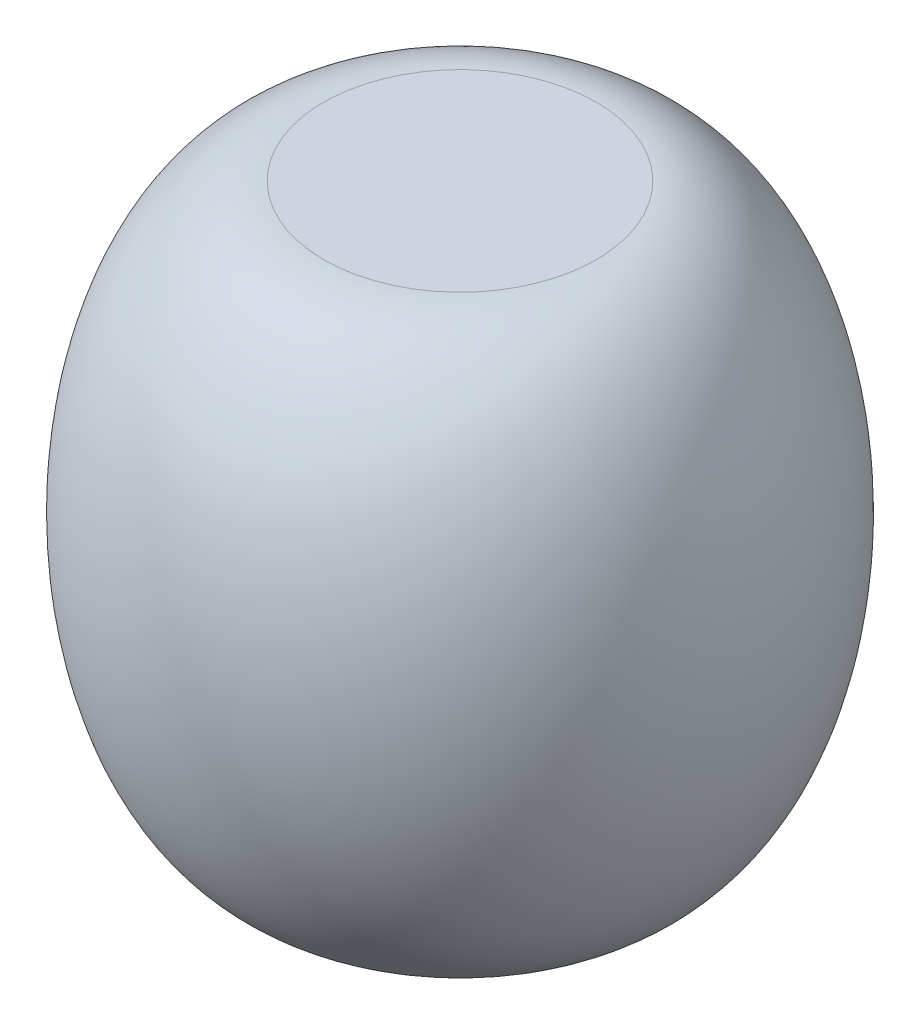
ISO-10303-21;
HEADER;
FILE_DESCRIPTION(('STEP AP214'),'2;1');
FILE_NAME('part.step','',(''),(''),'','','');
FILE_SCHEMA(('AUTOMOTIVE_DESIGN { 1 0 10303 214 1 1 1 1 }'));
ENDSEC;
DATA;
#1=APPLICATION_CONTEXT('core data for automotive mechanical design processes');
#2=APPLICATION_PROTOCOL_DEFINITION('international standard','automotive_design',2000,#1);
#3=PRODUCT_CONTEXT('',#1,'mechanical');
#4=PRODUCT('Part','Part','',(#3));
#5=PRODUCT_RELATED_PRODUCT_CATEGORY('part','',(#4));
#6=PRODUCT_DEFINITION_FORMATION('','',#4);
#7=PRODUCT_DEFINITION_CONTEXT('part definition',#1,'design');
#8=PRODUCT_DEFINITION('design','',#6,#7);
#9=PRODUCT_DEFINITION_SHAPE('','',#8);
#10=(LENGTH_UNIT() NAMED_UNIT(*) SI_UNIT(.MILLI.,.METRE.));
#11=(NAMED_UNIT(*) PLANE_ANGLE_UNIT() SI_UNIT($,.RADIAN.));
#12=(NAMED_UNIT(*) SI_UNIT($,.STERADIAN.) SOLID_ANGLE_UNIT());
#13=UNCERTAINTY_MEASURE_WITH_UNIT(LENGTH_MEASURE(1.E-05),#10,'distance_accuracy_value','');
#14=(GEOMETRIC_REPRESENTATION_CONTEXT(3) GLOBAL_UNCERTAINTY_ASSIGNED_CONTEXT((#13)) GLOBAL_UNIT_ASSIGNED_CONTEXT((#10,
#11,#12)) REPRESENTATION_CONTEXT('',''));
#15=CARTESIAN_POINT('',(0.,0.,0.));
#16=DIRECTION('',(0.,0.,1.));
#17=DIRECTION('',(1.,0.,0.));
#18=AXIS2_PLACEMENT_3D('',#15,#16,#17);
#19=CARTESIAN_POINT('',(0.,0.,0.));
#20=DIRECTION('',(0.,-1.,0.));
#21=DIRECTION('',(0.,0.,-1.));
#22=AXIS2_PLACEMENT_3D('',#19,#20,#21);
#23=PLANE('',#22);
#24=CARTESIAN_POINT('',(0.,0.,0.));
#25=DIRECTION('',(0.,-1.,0.));
#26=DIRECTION('',(0.,0.,-1.));
#27=AXIS2_PLACEMENT_3D('',#24,#25,#26);
#28=CIRCLE('',#27,12.1296442617817);
#29=CARTESIAN_POINT('',(0.,0.,-12.1296442617817));
#30=VERTEX_POINT('',#29);
#31=EDGE_CURVE('E10',#30,#30,#28,.T.);
#32=ORIENTED_EDGE('',*,*,#31,.T.);
#33=EDGE_LOOP('',(#32));
#34=FACE_BOUND('',#33,.T.);
#35=ADVANCED_FACE('F39',(#34),#23,.T.);
#36=CARTESIAN_POINT('',(12.1296441758871,25.5,0.));
#37=DIRECTION('',(0.,0.,1.));
#38=DIRECTION('',(-4.78377216652085E-09,1.,0.));
#39=AXIS2_PLACEMENT_3D('',#36,#37,#38);
#40=ELLIPSE('',#39,25.5,13.8703558241129);
#41=TRIMMED_CURVE('',#40,(PARAMETER_VALUE(2.07718598513308)),
(PARAMETER_VALUE(7.34759195804682)),.T.,.PARAMETER.);
#42=CARTESIAN_POINT('',(0.,0.,0.));
#43=DIRECTION('',(0.,-1.,0.));
#44=AXIS1_PLACEMENT('',#42,#43);
#45=SURFACE_OF_REVOLUTION('',#41,#44);
#46=CARTESIAN_POINT('',(0.,51.,0.));
#47=DIRECTION('',(0.,-1.,0.));
#48=DIRECTION('',(0.,0.,-1.));
#49=AXIS2_PLACEMENT_3D('',#46,#47,#48);
#50=CIRCLE('',#49,12.1296442617817);
#51=CARTESIAN_POINT('',(0.,51.,-12.1296442617817));
#52=VERTEX_POINT('',#51);
#53=EDGE_CURVE('E45',#52,#52,#50,.T.);
#54=ORIENTED_EDGE('',*,*,#53,.T.);
#55=EDGE_LOOP('',(#54));
#56=FACE_BOUND('',#55,.T.);
#57=ORIENTED_EDGE('',*,*,#31,.F.);
#58=EDGE_LOOP('',(#57));
#59=FACE_BOUND('',#58,.T.);
#60=ADVANCED_FACE('F53',(#56,#59),#45,.F.);
#61=CARTESIAN_POINT('',(0.,51.,0.));
#62=DIRECTION('',(0.,1.,0.));
#63=DIRECTION('',(0.,0.,1.));
#64=AXIS2_PLACEMENT_3D('',#61,#62,#63);
#65=PLANE('',#64);
#66=ORIENTED_EDGE('',*,*,#53,.F.);
#67=EDGE_LOOP('',(#66));
#68=FACE_BOUND('',#67,.T.);
#69=ADVANCED_FACE('F56',(#68),#65,.T.);
#70=CLOSED_SHELL('',(#35,#60,#69));
#71=MANIFOLD_SOLID_BREP('B2',#70);
#72=ADVANCED_BREP_SHAPE_REPRESENTATION('',(#18,#71),#14);
#73=SHAPE_DEFINITION_REPRESENTATION(#9,#72);
ENDSEC;
END-ISO-10303-21;
